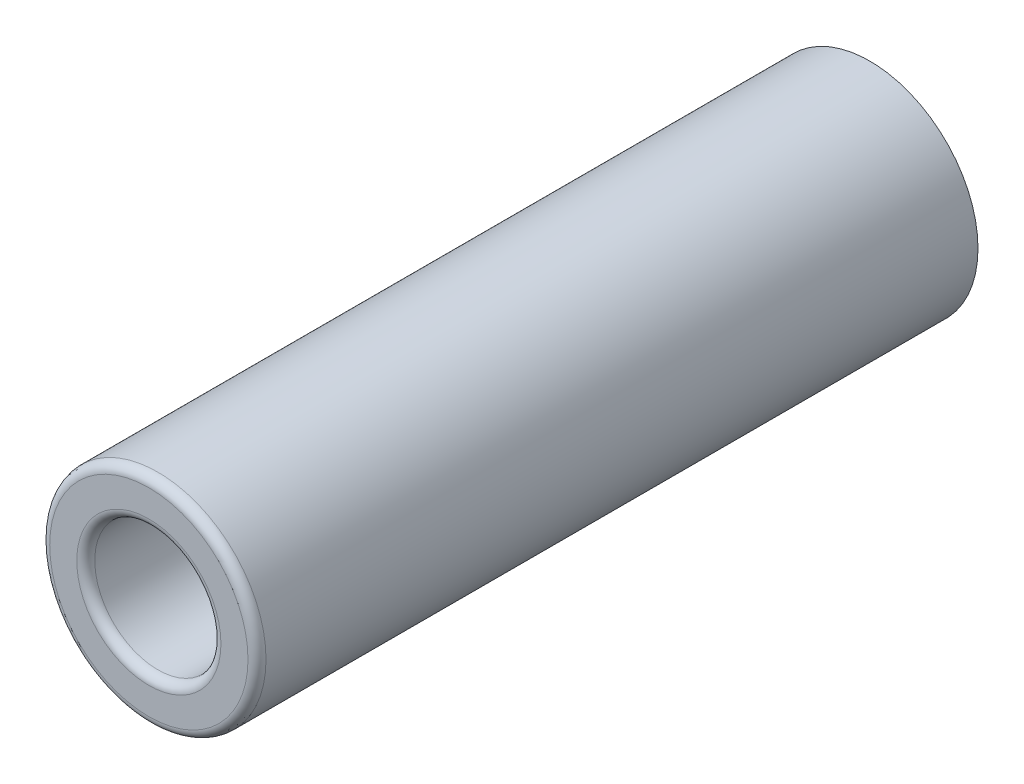
ISO-10303-21;
HEADER;
FILE_DESCRIPTION(('STEP AP214'),'2;1');
FILE_NAME('part.step','',(''),(''),'','','');
FILE_SCHEMA(('AUTOMOTIVE_DESIGN { 1 0 10303 214 1 1 1 1 }'));
ENDSEC;
DATA;
#1=APPLICATION_CONTEXT('core data for automotive mechanical design processes');
#2=APPLICATION_PROTOCOL_DEFINITION('international standard','automotive_design',2000,#1);
#3=PRODUCT_CONTEXT('',#1,'mechanical');
#4=PRODUCT('Part','Part','',(#3));
#5=PRODUCT_RELATED_PRODUCT_CATEGORY('part','',(#4));
#6=PRODUCT_DEFINITION_FORMATION('','',#4);
#7=PRODUCT_DEFINITION_CONTEXT('part definition',#1,'design');
#8=PRODUCT_DEFINITION('design','',#6,#7);
#9=PRODUCT_DEFINITION_SHAPE('','',#8);
#10=(LENGTH_UNIT() NAMED_UNIT(*) SI_UNIT(.MILLI.,.METRE.));
#11=(NAMED_UNIT(*) PLANE_ANGLE_UNIT() SI_UNIT($,.RADIAN.));
#12=(NAMED_UNIT(*) SI_UNIT($,.STERADIAN.) SOLID_ANGLE_UNIT());
#13=UNCERTAINTY_MEASURE_WITH_UNIT(LENGTH_MEASURE(1.E-05),#10,'distance_accuracy_value','');
#14=(GEOMETRIC_REPRESENTATION_CONTEXT(3) GLOBAL_UNCERTAINTY_ASSIGNED_CONTEXT((#13)) GLOBAL_UNIT_ASSIGNED_CONTEXT((#10,
#11,#12)) REPRESENTATION_CONTEXT('',''));
#15=CARTESIAN_POINT('',(0.,0.,0.));
#16=DIRECTION('',(0.,0.,1.));
#17=DIRECTION('',(1.,0.,0.));
#18=AXIS2_PLACEMENT_3D('',#15,#16,#17);
#19=CARTESIAN_POINT('',(0.,0.,40.));
#20=DIRECTION('',(0.,0.,1.));
#21=DIRECTION('',(1.,0.,0.));
#22=AXIS2_PLACEMENT_3D('',#19,#20,#21);
#23=PLANE('',#22);
#24=CARTESIAN_POINT('',(0.,0.,40.));
#25=DIRECTION('',(0.,0.,1.));
#26=DIRECTION('',(1.,0.,0.));
#27=AXIS2_PLACEMENT_3D('',#24,#25,#26);
#28=CIRCLE('',#27,4.);
#29=CARTESIAN_POINT('',(4.,0.,40.));
#30=VERTEX_POINT('',#29);
#31=EDGE_CURVE('E10',#30,#30,#28,.F.);
#32=ORIENTED_EDGE('',*,*,#31,.T.);
#33=EDGE_LOOP('',(#32));
#34=FACE_BOUND('',#33,.T.);
#35=CARTESIAN_POINT('',(0.,0.,40.));
#36=DIRECTION('',(0.,0.,1.));
#37=DIRECTION('',(1.,0.,0.));
#38=AXIS2_PLACEMENT_3D('',#35,#36,#37);
#39=CIRCLE('',#38,5.5);
#40=CARTESIAN_POINT('',(5.5,0.,40.));
#41=VERTEX_POINT('',#40);
#42=EDGE_CURVE('E59',#41,#41,#39,.T.);
#43=ORIENTED_EDGE('',*,*,#42,.T.);
#44=EDGE_LOOP('',(#43));
#45=FACE_BOUND('',#44,.T.);
#46=ADVANCED_FACE('F41',(#34,#45),#23,.T.);
#47=CARTESIAN_POINT('',(0.,0.,0.));
#48=DIRECTION('',(0.,0.,1.));
#49=DIRECTION('',(1.,0.,0.));
#50=AXIS2_PLACEMENT_3D('',#47,#48,#49);
#51=PLANE('',#50);
#52=CARTESIAN_POINT('',(0.,0.,0.));
#53=DIRECTION('',(0.,0.,1.));
#54=DIRECTION('',(1.,0.,0.));
#55=AXIS2_PLACEMENT_3D('',#52,#53,#54);
#56=CIRCLE('',#55,6.);
#57=CARTESIAN_POINT('',(6.,0.,0.));
#58=VERTEX_POINT('',#57);
#59=EDGE_CURVE('E65',#58,#58,#56,.T.);
#60=ORIENTED_EDGE('',*,*,#59,.F.);
#61=EDGE_LOOP('',(#60));
#62=FACE_BOUND('',#61,.T.);
#63=CARTESIAN_POINT('',(0.,0.,0.));
#64=DIRECTION('',(0.,0.,1.));
#65=DIRECTION('',(1.,0.,0.));
#66=AXIS2_PLACEMENT_3D('',#63,#64,#65);
#67=CIRCLE('',#66,3.5);
#68=CARTESIAN_POINT('',(3.5,0.,0.));
#69=VERTEX_POINT('',#68);
#70=EDGE_CURVE('E69',#69,#69,#67,.T.);
#71=ORIENTED_EDGE('',*,*,#70,.T.);
#72=EDGE_LOOP('',(#71));
#73=FACE_BOUND('',#72,.T.);
#74=ADVANCED_FACE('F74',(#62,#73),#51,.F.);
#75=CARTESIAN_POINT('',(0.,0.,40.));
#76=DIRECTION('',(0.,0.,-1.));
#77=DIRECTION('',(-1.,0.,0.));
#78=AXIS2_PLACEMENT_3D('',#75,#76,#77);
#79=CYLINDRICAL_SURFACE('',#78,6.);
#80=CARTESIAN_POINT('',(0.,0.,39.5));
#81=DIRECTION('',(0.,0.,1.));
#82=DIRECTION('',(1.,0.,0.));
#83=AXIS2_PLACEMENT_3D('',#80,#81,#82);
#84=CIRCLE('',#83,6.);
#85=CARTESIAN_POINT('',(6.,0.,39.5));
#86=VERTEX_POINT('',#85);
#87=EDGE_CURVE('E54',#86,#86,#84,.F.);
#88=ORIENTED_EDGE('',*,*,#87,.T.);
#89=EDGE_LOOP('',(#88));
#90=FACE_BOUND('',#89,.T.);
#91=ORIENTED_EDGE('',*,*,#59,.T.);
#92=EDGE_LOOP('',(#91));
#93=FACE_BOUND('',#92,.T.);
#94=ADVANCED_FACE('F79',(#90,#93),#79,.T.);
#95=CARTESIAN_POINT('',(0.,0.,40.));
#96=DIRECTION('',(0.,0.,-1.));
#97=DIRECTION('',(-1.,0.,0.));
#98=AXIS2_PLACEMENT_3D('',#95,#96,#97);
#99=CYLINDRICAL_SURFACE('',#98,3.5);
#100=CARTESIAN_POINT('',(0.,0.,39.5));
#101=DIRECTION('',(0.,0.,1.));
#102=DIRECTION('',(1.,0.,0.));
#103=AXIS2_PLACEMENT_3D('',#100,#101,#102);
#104=CIRCLE('',#103,3.5);
#105=CARTESIAN_POINT('',(3.5,0.,39.5));
#106=VERTEX_POINT('',#105);
#107=EDGE_CURVE('E49',#106,#106,#104,.T.);
#108=ORIENTED_EDGE('',*,*,#107,.T.);
#109=EDGE_LOOP('',(#108));
#110=FACE_BOUND('',#109,.T.);
#111=ORIENTED_EDGE('',*,*,#70,.F.);
#112=EDGE_LOOP('',(#111));
#113=FACE_BOUND('',#112,.T.);
#114=ADVANCED_FACE('F76',(#110,#113),#99,.F.);
#115=CARTESIAN_POINT('',(0.,0.,39.5));
#116=DIRECTION('',(0.,0.,1.));
#117=DIRECTION('',(1.,0.,0.));
#118=AXIS2_PLACEMENT_3D('',#115,#116,#117);
#119=TOROIDAL_SURFACE('',#118,5.5,0.5);
#120=ORIENTED_EDGE('',*,*,#87,.F.);
#121=EDGE_LOOP('',(#120));
#122=FACE_BOUND('',#121,.T.);
#123=ORIENTED_EDGE('',*,*,#42,.F.);
#124=EDGE_LOOP('',(#123));
#125=FACE_BOUND('',#124,.T.);
#126=ADVANCED_FACE('F78',(#122,#125),#119,.T.);
#127=CARTESIAN_POINT('',(0.,0.,39.5));
#128=DIRECTION('',(0.,0.,1.));
#129=DIRECTION('',(1.,0.,0.));
#130=AXIS2_PLACEMENT_3D('',#127,#128,#129);
#131=TOROIDAL_SURFACE('',#130,4.,0.5);
#132=ORIENTED_EDGE('',*,*,#31,.F.);
#133=EDGE_LOOP('',(#132));
#134=FACE_BOUND('',#133,.T.);
#135=ORIENTED_EDGE('',*,*,#107,.F.);
#136=EDGE_LOOP('',(#135));
#137=FACE_BOUND('',#136,.T.);
#138=ADVANCED_FACE('F43',(#134,#137),#131,.T.);
#139=CLOSED_SHELL('',(#46,#74,#94,#114,#126,#138));
#140=MANIFOLD_SOLID_BREP('B2',#139);
#141=ADVANCED_BREP_SHAPE_REPRESENTATION('',(#18,#140),#14);
#142=SHAPE_DEFINITION_REPRESENTATION(#9,#141);
ENDSEC;
END-ISO-10303-21;
